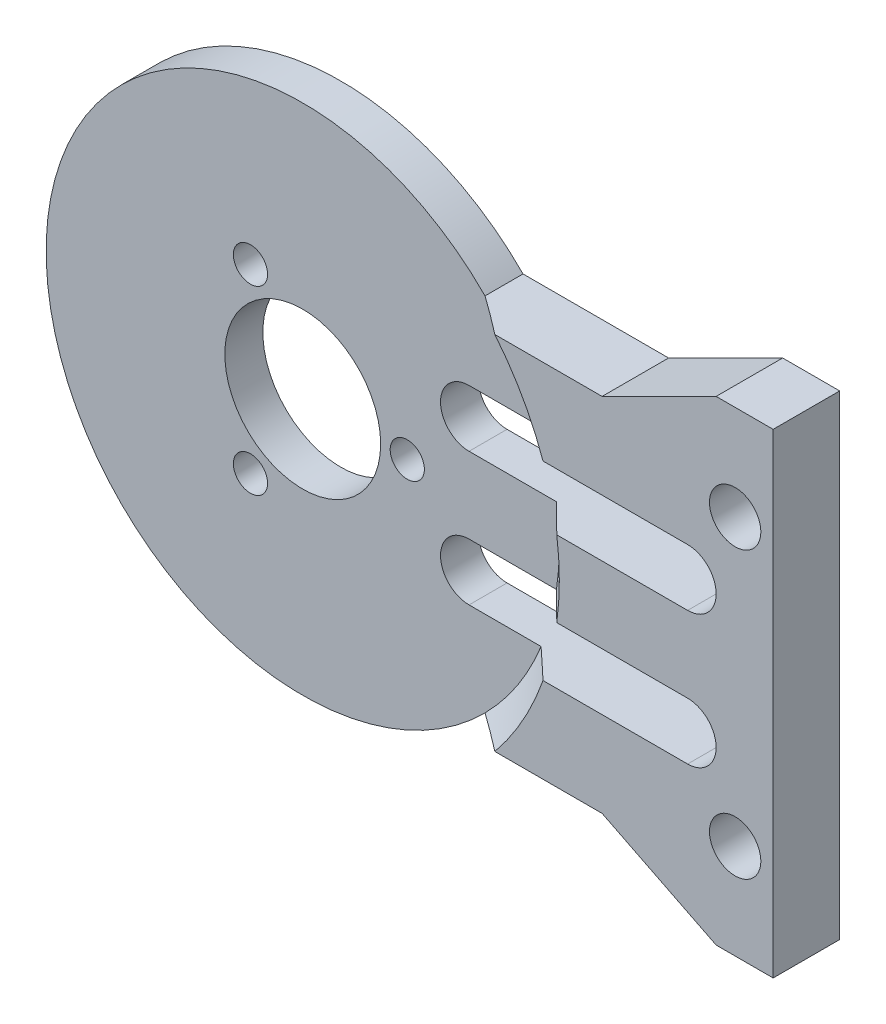
ISO-10303-21;
HEADER;
FILE_DESCRIPTION(('STEP AP214'),'2;1');
FILE_NAME('part.step','',(''),(''),'','','');
FILE_SCHEMA(('AUTOMOTIVE_DESIGN { 1 0 10303 214 1 1 1 1 }'));
ENDSEC;
DATA;
#1=APPLICATION_CONTEXT('core data for automotive mechanical design processes');
#2=APPLICATION_PROTOCOL_DEFINITION('international standard','automotive_design',2000,#1);
#3=PRODUCT_CONTEXT('',#1,'mechanical');
#4=PRODUCT('Part','Part','',(#3));
#5=PRODUCT_RELATED_PRODUCT_CATEGORY('part','',(#4));
#6=PRODUCT_DEFINITION_FORMATION('','',#4);
#7=PRODUCT_DEFINITION_CONTEXT('part definition',#1,'design');
#8=PRODUCT_DEFINITION('design','',#6,#7);
#9=PRODUCT_DEFINITION_SHAPE('','',#8);
#10=(LENGTH_UNIT() NAMED_UNIT(*) SI_UNIT(.MILLI.,.METRE.));
#11=(NAMED_UNIT(*) PLANE_ANGLE_UNIT() SI_UNIT($,.RADIAN.));
#12=(NAMED_UNIT(*) SI_UNIT($,.STERADIAN.) SOLID_ANGLE_UNIT());
#13=UNCERTAINTY_MEASURE_WITH_UNIT(LENGTH_MEASURE(1.E-05),#10,'distance_accuracy_value','');
#14=(GEOMETRIC_REPRESENTATION_CONTEXT(3) GLOBAL_UNCERTAINTY_ASSIGNED_CONTEXT((#13)) GLOBAL_UNIT_ASSIGNED_CONTEXT((#10,
#11,#12)) REPRESENTATION_CONTEXT('',''));
#15=CARTESIAN_POINT('',(0.,0.,0.));
#16=DIRECTION('',(0.,0.,1.));
#17=DIRECTION('',(1.,0.,0.));
#18=AXIS2_PLACEMENT_3D('',#15,#16,#17);
#19=CARTESIAN_POINT('',(0.,0.,3.50000000000002));
#20=DIRECTION('',(0.,0.,1.));
#21=DIRECTION('',(0.,-1.,0.));
#22=AXIS2_PLACEMENT_3D('',#19,#20,#21);
#23=CONICAL_SURFACE('',#22,15.,0.785398163397448);
#24=CARTESIAN_POINT('',(0.,0.,3.50000000000002));
#25=DIRECTION('',(0.,0.,1.));
#26=DIRECTION('',(0.,-1.,0.));
#27=AXIS2_PLACEMENT_3D('',#24,#25,#26);
#28=CIRCLE('',#27,15.);
#29=CARTESIAN_POINT('',(14.142135623731,-5.,3.50000000000003));
#30=VERTEX_POINT('',#29);
#31=CARTESIAN_POINT('',(11.6081867662439,-9.5,3.50000000000001));
#32=VERTEX_POINT('',#31);
#33=EDGE_CURVE('E139',#30,#32,#28,.F.);
#34=ORIENTED_EDGE('',*,*,#33,.F.);
#35=CARTESIAN_POINT('',(12.5399362039845,-5.,2.00000000000002));
#36=CARTESIAN_POINT('',(12.6739419625664,-5.,2.12447668089387));
#37=CARTESIAN_POINT('',(12.8078120502152,-5.,2.24909931975893));
#38=CARTESIAN_POINT('',(13.0753009891734,-5.,2.49861302935809));
#39=CARTESIAN_POINT('',(13.2089198413421,-5.,2.62350409917075));
#40=CARTESIAN_POINT('',(13.4759272658063,-5.,2.87353197709315));
#41=CARTESIAN_POINT('',(13.6093158382177,-5.,2.99866878507895));
#42=CARTESIAN_POINT('',(13.8758806951531,-5.,3.24916922865584));
#43=CARTESIAN_POINT('',(14.0090569789481,-5.,3.3745328650226));
#44=CARTESIAN_POINT('',(14.142135623731,-5.,3.50000000000003));
#45=B_SPLINE_CURVE_WITH_KNOTS('',3,(#35,#36,#37,#38,#39,#40,#41,#42,#43,#44),.UNSPECIFIED.,.F.,
.F.,(4,2,2,2,4),(0.,0.548696328755875,1.09739077699587,1.64608494855603,2.19478100003117),.UNSPECIFIED.);
#46=CARTESIAN_POINT('',(12.5399362039845,-5.,2.));
#47=VERTEX_POINT('',#46);
#48=EDGE_CURVE('E295',#47,#30,#45,.T.);
#49=ORIENTED_EDGE('',*,*,#48,.F.);
#50=CARTESIAN_POINT('',(0.,0.,2.));
#51=DIRECTION('',(0.,0.,1.));
#52=DIRECTION('',(0.,-1.,0.));
#53=AXIS2_PLACEMENT_3D('',#50,#51,#52);
#54=CIRCLE('',#53,13.5);
#55=CARTESIAN_POINT('',(9.59166304662544,-9.5,2.));
#56=VERTEX_POINT('',#55);
#57=EDGE_CURVE('E476',#56,#47,#54,.T.);
#58=ORIENTED_EDGE('',*,*,#57,.F.);
#59=CARTESIAN_POINT('',(11.6081867662439,-9.5,3.5));
#60=CARTESIAN_POINT('',(11.4425349588355,-9.5,3.37181039171212));
#61=CARTESIAN_POINT('',(11.2763537392727,-9.5,3.24430205398962));
#62=CARTESIAN_POINT('',(10.9428462642512,-9.5,2.9908283329708));
#63=CARTESIAN_POINT('',(10.7755201292658,-9.5,2.86486279111046));
#64=CARTESIAN_POINT('',(10.4395995981307,-9.5,2.6146264080941));
#65=CARTESIAN_POINT('',(10.2710051815198,-9.5,2.49035559437036));
#66=CARTESIAN_POINT('',(9.9324127559008,-9.5,2.24370462569485));
#67=CARTESIAN_POINT('',(9.76241460313073,-9.5,2.12132466817207));
#68=CARTESIAN_POINT('',(9.59166304662544,-9.5,2.));
#69=B_SPLINE_CURVE_WITH_KNOTS('',3,(#59,#60,#61,#62,#63,#64,#65,#66,#67,#68),.UNSPECIFIED.,.F.,
.F.,(4,2,2,2,4),(0.,0.628377900400823,1.25669066667378,1.88501359129552,2.51340168327007),.UNSPECIFIED.);
#70=EDGE_CURVE('E333',#32,#56,#69,.T.);
#71=ORIENTED_EDGE('',*,*,#70,.F.);
#72=EDGE_LOOP('',(#34,#49,#58,#71));
#73=FACE_BOUND('',#72,.T.);
#74=ADVANCED_FACE('F17',(#73),#23,.F.);
#75=CARTESIAN_POINT('',(0.,0.,3.5));
#76=DIRECTION('',(0.,0.,1.));
#77=DIRECTION('',(1.,0.,0.));
#78=AXIS2_PLACEMENT_3D('',#75,#76,#77);
#79=CONICAL_SURFACE('',#78,15.,0.785398163397448);
#80=CARTESIAN_POINT('',(0.,0.,2.00000000000001));
#81=DIRECTION('',(0.,0.,1.));
#82=DIRECTION('',(1.,0.,0.));
#83=AXIS2_PLACEMENT_3D('',#80,#81,#82);
#84=CIRCLE('',#83,13.5);
#85=CARTESIAN_POINT('',(13.3510299228187,-2.,2.00000000000001));
#86=VERTEX_POINT('',#85);
#87=CARTESIAN_POINT('',(13.3510299228187,2.,2.));
#88=VERTEX_POINT('',#87);
#89=EDGE_CURVE('E473',#86,#88,#84,.T.);
#90=ORIENTED_EDGE('',*,*,#89,.F.);
#91=CARTESIAN_POINT('',(14.8660687473185,-2.,3.5));
#92=CARTESIAN_POINT('',(14.6136948517418,-2.,3.24986609751232));
#93=CARTESIAN_POINT('',(14.3612546690459,-2.,2.99979914673077));
#94=CARTESIAN_POINT('',(13.856241727547,-2.,2.49979914672979));
#95=CARTESIAN_POINT('',(13.6036689687429,-2.,2.24986609751134));
#96=CARTESIAN_POINT('',(13.3510299228187,-2.,2.));
#97=B_SPLINE_CURVE_WITH_KNOTS('',3,(#91,#92,#93,#94,#95,#96),.UNSPECIFIED.,.F.,.F.,(4,2,4),(0.,
1.06599049311637,2.13198099412171),.UNSPECIFIED.);
#98=CARTESIAN_POINT('',(14.8660687473185,-2.,3.5));
#99=VERTEX_POINT('',#98);
#100=EDGE_CURVE('E134',#99,#86,#97,.T.);
#101=ORIENTED_EDGE('',*,*,#100,.F.);
#102=CARTESIAN_POINT('',(0.,0.,3.5));
#103=DIRECTION('',(0.,0.,1.));
#104=DIRECTION('',(1.,0.,0.));
#105=AXIS2_PLACEMENT_3D('',#102,#103,#104);
#106=CIRCLE('',#105,15.);
#107=CARTESIAN_POINT('',(14.8660687473185,2.,3.5));
#108=VERTEX_POINT('',#107);
#109=EDGE_CURVE('E21',#108,#99,#106,.F.);
#110=ORIENTED_EDGE('',*,*,#109,.F.);
#111=CARTESIAN_POINT('',(14.8660687473185,2.,3.5));
#112=CARTESIAN_POINT('',(14.6136948517418,2.,3.24986609751232));
#113=CARTESIAN_POINT('',(14.3612546690459,2.,2.99979914673077));
#114=CARTESIAN_POINT('',(13.856241727547,2.,2.49979914672979));
#115=CARTESIAN_POINT('',(13.6036689687429,2.,2.24986609751134));
#116=CARTESIAN_POINT('',(13.3510299228187,2.,2.00000000000001));
#117=B_SPLINE_CURVE_WITH_KNOTS('',3,(#111,#112,#113,#114,#115,#116),.UNSPECIFIED.,.F.,.F.,(4,2,
4),(0.,1.06599049311637,2.13198099412171),.UNSPECIFIED.);
#118=EDGE_CURVE('E133',#108,#88,#117,.T.);
#119=ORIENTED_EDGE('',*,*,#118,.T.);
#120=EDGE_LOOP('',(#90,#101,#110,#119));
#121=FACE_BOUND('',#120,.T.);
#122=ADVANCED_FACE('F132',(#121),#79,.F.);
#123=CARTESIAN_POINT('',(6.375,0.,3.5));
#124=DIRECTION('',(0.,0.,1.));
#125=DIRECTION('',(1.,0.,0.));
#126=AXIS2_PLACEMENT_3D('',#123,#124,#125);
#127=PLANE('',#126);
#128=CARTESIAN_POINT('',(24.25,7.5,3.5));
#129=DIRECTION('',(0.,0.,-1.));
#130=DIRECTION('',(-1.,0.,0.));
#131=AXIS2_PLACEMENT_3D('',#128,#129,#130);
#132=CIRCLE('',#131,1.35);
#133=CARTESIAN_POINT('',(22.9,7.5,3.5));
#134=VERTEX_POINT('',#133);
#135=EDGE_CURVE('E313',#134,#134,#132,.T.);
#136=ORIENTED_EDGE('',*,*,#135,.T.);
#137=EDGE_LOOP('',(#136));
#138=FACE_BOUND('',#137,.T.);
#139=CARTESIAN_POINT('',(24.25,-7.5,3.5));
#140=DIRECTION('',(0.,0.,-1.));
#141=DIRECTION('',(-1.,0.,0.));
#142=AXIS2_PLACEMENT_3D('',#139,#140,#141);
#143=CIRCLE('',#142,1.35);
#144=CARTESIAN_POINT('',(22.9,-7.5,3.5));
#145=VERTEX_POINT('',#144);
#146=EDGE_CURVE('E316',#145,#145,#143,.T.);
#147=ORIENTED_EDGE('',*,*,#146,.T.);
#148=EDGE_LOOP('',(#147));
#149=FACE_BOUND('',#148,.T.);
#150=DIRECTION('',(-0.894427190999916,-0.447213595499958,0.));
#151=VECTOR('',#150,1.);
#152=CARTESIAN_POINT('',(23.25,12.5,3.5));
#153=LINE('',#152,#151);
#154=CARTESIAN_POINT('',(17.25,9.5,3.5));
#155=VERTEX_POINT('',#154);
#156=CARTESIAN_POINT('',(23.25,12.5,3.5));
#157=VERTEX_POINT('',#156);
#158=EDGE_CURVE('E166',#155,#157,#153,.F.);
#159=ORIENTED_EDGE('',*,*,#158,.F.);
#160=DIRECTION('',(1.,0.,0.));
#161=VECTOR('',#160,1.);
#162=CARTESIAN_POINT('',(17.25,9.5,3.5));
#163=LINE('',#162,#161);
#164=CARTESIAN_POINT('',(11.6081867662439,9.5,3.5));
#165=VERTEX_POINT('',#164);
#166=EDGE_CURVE('E332',#165,#155,#163,.T.);
#167=ORIENTED_EDGE('',*,*,#166,.F.);
#168=CARTESIAN_POINT('',(0.,0.,3.5));
#169=DIRECTION('',(0.,0.,1.));
#170=DIRECTION('',(1.,0.,0.));
#171=AXIS2_PLACEMENT_3D('',#168,#169,#170);
#172=CIRCLE('',#171,15.);
#173=CARTESIAN_POINT('',(14.142135623731,5.,3.5));
#174=VERTEX_POINT('',#173);
#175=EDGE_CURVE('E483',#165,#174,#172,.F.);
#176=ORIENTED_EDGE('',*,*,#175,.T.);
#177=DIRECTION('',(1.,0.,0.));
#178=VECTOR('',#177,1.);
#179=CARTESIAN_POINT('',(8.75,5.,3.5));
#180=LINE('',#179,#178);
#181=CARTESIAN_POINT('',(21.75,5.,3.5));
#182=VERTEX_POINT('',#181);
#183=EDGE_CURVE('E500',#174,#182,#180,.T.);
#184=ORIENTED_EDGE('',*,*,#183,.T.);
#185=CARTESIAN_POINT('',(21.75,3.5,3.5));
#186=DIRECTION('',(0.,0.,-1.));
#187=DIRECTION('',(-1.,0.,0.));
#188=AXIS2_PLACEMENT_3D('',#185,#186,#187);
#189=CIRCLE('',#188,1.5);
#190=CARTESIAN_POINT('',(21.75,2.,3.5));
#191=VERTEX_POINT('',#190);
#192=EDGE_CURVE('E153',#182,#191,#189,.T.);
#193=ORIENTED_EDGE('',*,*,#192,.T.);
#194=DIRECTION('',(1.,0.,0.));
#195=VECTOR('',#194,1.);
#196=CARTESIAN_POINT('',(21.75,2.,3.5));
#197=LINE('',#196,#195);
#198=EDGE_CURVE('E144',#191,#108,#197,.F.);
#199=ORIENTED_EDGE('',*,*,#198,.T.);
#200=ORIENTED_EDGE('',*,*,#109,.T.);
#201=DIRECTION('',(1.,0.,0.));
#202=VECTOR('',#201,1.);
#203=CARTESIAN_POINT('',(21.75,-2.,3.5));
#204=LINE('',#203,#202);
#205=CARTESIAN_POINT('',(21.75,-2.,3.5));
#206=VERTEX_POINT('',#205);
#207=EDGE_CURVE('E160',#206,#99,#204,.F.);
#208=ORIENTED_EDGE('',*,*,#207,.F.);
#209=CARTESIAN_POINT('',(21.75,-3.5,3.5));
#210=DIRECTION('',(0.,0.,1.));
#211=DIRECTION('',(1.,0.,0.));
#212=AXIS2_PLACEMENT_3D('',#209,#210,#211);
#213=CIRCLE('',#212,1.5);
#214=CARTESIAN_POINT('',(21.75,-5.,3.5));
#215=VERTEX_POINT('',#214);
#216=EDGE_CURVE('E301',#206,#215,#213,.F.);
#217=ORIENTED_EDGE('',*,*,#216,.T.);
#218=DIRECTION('',(1.,0.,0.));
#219=VECTOR('',#218,1.);
#220=CARTESIAN_POINT('',(8.75,-5.,3.5));
#221=LINE('',#220,#219);
#222=EDGE_CURVE('E300',#30,#215,#221,.T.);
#223=ORIENTED_EDGE('',*,*,#222,.F.);
#224=ORIENTED_EDGE('',*,*,#33,.T.);
#225=DIRECTION('',(1.,0.,0.));
#226=VECTOR('',#225,1.);
#227=CARTESIAN_POINT('',(9.59166304662544,-9.5,3.5));
#228=LINE('',#227,#226);
#229=CARTESIAN_POINT('',(17.25,-9.5,3.5));
#230=VERTEX_POINT('',#229);
#231=EDGE_CURVE('E194',#230,#32,#228,.F.);
#232=ORIENTED_EDGE('',*,*,#231,.F.);
#233=DIRECTION('',(0.894427190999916,-0.447213595499958,0.));
#234=VECTOR('',#233,1.);
#235=CARTESIAN_POINT('',(17.25,-9.5,3.5));
#236=LINE('',#235,#234);
#237=CARTESIAN_POINT('',(23.25,-12.5,3.5));
#238=VERTEX_POINT('',#237);
#239=EDGE_CURVE('E191',#238,#230,#236,.F.);
#240=ORIENTED_EDGE('',*,*,#239,.F.);
#241=DIRECTION('',(1.,0.,0.));
#242=VECTOR('',#241,1.);
#243=CARTESIAN_POINT('',(23.25,-12.5,3.5));
#244=LINE('',#243,#242);
#245=CARTESIAN_POINT('',(26.25,-12.5,3.5));
#246=VERTEX_POINT('',#245);
#247=EDGE_CURVE('E185',#246,#238,#244,.F.);
#248=ORIENTED_EDGE('',*,*,#247,.F.);
#249=DIRECTION('',(0.,1.,0.));
#250=VECTOR('',#249,1.);
#251=CARTESIAN_POINT('',(26.25,-12.5,3.5));
#252=LINE('',#251,#250);
#253=CARTESIAN_POINT('',(26.25,12.5,3.5));
#254=VERTEX_POINT('',#253);
#255=EDGE_CURVE('E179',#254,#246,#252,.F.);
#256=ORIENTED_EDGE('',*,*,#255,.F.);
#257=DIRECTION('',(-1.,0.,0.));
#258=VECTOR('',#257,1.);
#259=CARTESIAN_POINT('',(26.25,12.5,3.5));
#260=LINE('',#259,#258);
#261=EDGE_CURVE('E173',#157,#254,#260,.F.);
#262=ORIENTED_EDGE('',*,*,#261,.F.);
#263=EDGE_LOOP('',(#159,#167,#176,#184,#193,#199,#200,#208,#217,#223,#224,#232,#240,#248,#256,#262));
#264=FACE_BOUND('',#263,.T.);
#265=ADVANCED_FACE('F151',(#138,#149,#264),#127,.T.);
#266=CARTESIAN_POINT('',(0.,0.,3.50000000000002));
#267=DIRECTION('',(0.,0.,1.));
#268=DIRECTION('',(1.,0.,0.));
#269=AXIS2_PLACEMENT_3D('',#266,#267,#268);
#270=CONICAL_SURFACE('',#269,15.,0.785398163397448);
#271=ORIENTED_EDGE('',*,*,#175,.F.);
#272=CARTESIAN_POINT('',(9.59166304662544,9.5,2.));
#273=CARTESIAN_POINT('',(9.76241460313074,9.5,2.12132466817208));
#274=CARTESIAN_POINT('',(9.9324127559008,9.5,2.24370462569485));
#275=CARTESIAN_POINT('',(10.2710051815198,9.5,2.49035559437036));
#276=CARTESIAN_POINT('',(10.4395995981307,9.5,2.61462640809411));
#277=CARTESIAN_POINT('',(10.7755201292658,9.5,2.86486279111046));
#278=CARTESIAN_POINT('',(10.9428462642512,9.5,2.9908283329708));
#279=CARTESIAN_POINT('',(11.2763537392727,9.5,3.24430205398961));
#280=CARTESIAN_POINT('',(11.4425349588355,9.5,3.37181039171211));
#281=CARTESIAN_POINT('',(11.6081867662439,9.5,3.5));
#282=B_SPLINE_CURVE_WITH_KNOTS('',3,(#272,#273,#274,#275,#276,#277,#278,#279,#280,#281),
.UNSPECIFIED.,.F.,.F.,(4,2,2,2,4),(0.,0.628388091974549,1.25671101659629,1.88502378286924,
2.51340168327006),.UNSPECIFIED.);
#283=CARTESIAN_POINT('',(9.59166304662545,9.5,2.00000000000001));
#284=VERTEX_POINT('',#283);
#285=EDGE_CURVE('E325',#284,#165,#282,.T.);
#286=ORIENTED_EDGE('',*,*,#285,.F.);
#287=CARTESIAN_POINT('',(0.,0.,2.00000000000002));
#288=DIRECTION('',(0.,0.,1.));
#289=DIRECTION('',(1.,0.,0.));
#290=AXIS2_PLACEMENT_3D('',#287,#288,#289);
#291=CIRCLE('',#290,13.5);
#292=CARTESIAN_POINT('',(12.5399362039845,5.,2.00000000000002));
#293=VERTEX_POINT('',#292);
#294=EDGE_CURVE('E479',#293,#284,#291,.T.);
#295=ORIENTED_EDGE('',*,*,#294,.F.);
#296=CARTESIAN_POINT('',(12.5399362039845,5.,2.00000000000002));
#297=CARTESIAN_POINT('',(12.6739419625664,5.,2.12447668089387));
#298=CARTESIAN_POINT('',(12.8078120502152,5.,2.24909931975893));
#299=CARTESIAN_POINT('',(13.0753009891734,5.,2.49861302935809));
#300=CARTESIAN_POINT('',(13.2089198413421,5.,2.62350409917075));
#301=CARTESIAN_POINT('',(13.4759272658063,5.,2.87353197709315));
#302=CARTESIAN_POINT('',(13.6093158382177,5.,2.99866878507895));
#303=CARTESIAN_POINT('',(13.8758806951531,5.,3.24916922865583));
#304=CARTESIAN_POINT('',(14.0090569789481,5.,3.3745328650226));
#305=CARTESIAN_POINT('',(14.142135623731,5.,3.50000000000002));
#306=B_SPLINE_CURVE_WITH_KNOTS('',3,(#296,#297,#298,#299,#300,#301,#302,#303,#304,#305),
.UNSPECIFIED.,.F.,.F.,(4,2,2,2,4),(0.,0.54869632875587,1.09739077699586,1.64608494855602,
2.19478100003116),.UNSPECIFIED.);
#307=EDGE_CURVE('E235',#293,#174,#306,.T.);
#308=ORIENTED_EDGE('',*,*,#307,.T.);
#309=EDGE_LOOP('',(#271,#286,#295,#308));
#310=FACE_BOUND('',#309,.T.);
#311=ADVANCED_FACE('F245',(#310),#270,.F.);
#312=CARTESIAN_POINT('',(0.,0.,2.));
#313=DIRECTION('',(0.,0.,1.));
#314=DIRECTION('',(1.,0.,0.));
#315=AXIS2_PLACEMENT_3D('',#312,#313,#314);
#316=PLANE('',#315);
#317=CARTESIAN_POINT('',(0.,0.,2.));
#318=DIRECTION('',(0.,0.,1.));
#319=DIRECTION('',(1.,0.,0.));
#320=AXIS2_PLACEMENT_3D('',#317,#318,#319);
#321=CIRCLE('',#320,4.1);
#322=CARTESIAN_POINT('',(4.1,0.,2.));
#323=VERTEX_POINT('',#322);
#324=EDGE_CURVE('E231',#323,#323,#321,.F.);
#325=ORIENTED_EDGE('',*,*,#324,.T.);
#326=EDGE_LOOP('',(#325));
#327=FACE_BOUND('',#326,.T.);
#328=CARTESIAN_POINT('',(-2.75,4.76313972081441,2.));
#329=DIRECTION('',(0.,0.,-1.));
#330=DIRECTION('',(-1.,0.,0.));
#331=AXIS2_PLACEMENT_3D('',#328,#329,#330);
#332=CIRCLE('',#331,0.9);
#333=CARTESIAN_POINT('',(-3.65,4.76313972081441,2.));
#334=VERTEX_POINT('',#333);
#335=EDGE_CURVE('E304',#334,#334,#332,.T.);
#336=ORIENTED_EDGE('',*,*,#335,.T.);
#337=EDGE_LOOP('',(#336));
#338=FACE_BOUND('',#337,.T.);
#339=CARTESIAN_POINT('',(-2.75,-4.76313972081441,2.));
#340=DIRECTION('',(0.,0.,-1.));
#341=DIRECTION('',(-1.,0.,0.));
#342=AXIS2_PLACEMENT_3D('',#339,#340,#341);
#343=CIRCLE('',#342,0.9);
#344=CARTESIAN_POINT('',(-3.65,-4.76313972081441,2.));
#345=VERTEX_POINT('',#344);
#346=EDGE_CURVE('E307',#345,#345,#343,.T.);
#347=ORIENTED_EDGE('',*,*,#346,.T.);
#348=EDGE_LOOP('',(#347));
#349=FACE_BOUND('',#348,.T.);
#350=CARTESIAN_POINT('',(5.5,0.,2.));
#351=DIRECTION('',(0.,0.,-1.));
#352=DIRECTION('',(-1.,0.,0.));
#353=AXIS2_PLACEMENT_3D('',#350,#351,#352);
#354=CIRCLE('',#353,0.9);
#355=CARTESIAN_POINT('',(4.6,0.,2.));
#356=VERTEX_POINT('',#355);
#357=EDGE_CURVE('E310',#356,#356,#354,.T.);
#358=ORIENTED_EDGE('',*,*,#357,.T.);
#359=EDGE_LOOP('',(#358));
#360=FACE_BOUND('',#359,.T.);
#361=DIRECTION('',(1.,0.,0.));
#362=VECTOR('',#361,1.);
#363=CARTESIAN_POINT('',(21.75,-2.,2.));
#364=LINE('',#363,#362);
#365=CARTESIAN_POINT('',(8.75,-2.,2.));
#366=VERTEX_POINT('',#365);
#367=EDGE_CURVE('E163',#86,#366,#364,.F.);
#368=ORIENTED_EDGE('',*,*,#367,.F.);
#369=ORIENTED_EDGE('',*,*,#89,.T.);
#370=DIRECTION('',(1.,0.,0.));
#371=VECTOR('',#370,1.);
#372=CARTESIAN_POINT('',(21.75,2.,2.));
#373=LINE('',#372,#371);
#374=CARTESIAN_POINT('',(8.75,2.,2.));
#375=VERTEX_POINT('',#374);
#376=EDGE_CURVE('E147',#88,#375,#373,.F.);
#377=ORIENTED_EDGE('',*,*,#376,.T.);
#378=CARTESIAN_POINT('',(8.75,3.5,2.));
#379=DIRECTION('',(0.,0.,-1.));
#380=DIRECTION('',(-1.,0.,0.));
#381=AXIS2_PLACEMENT_3D('',#378,#379,#380);
#382=CIRCLE('',#381,1.5);
#383=CARTESIAN_POINT('',(8.75,5.,2.));
#384=VERTEX_POINT('',#383);
#385=EDGE_CURVE('E244',#375,#384,#382,.T.);
#386=ORIENTED_EDGE('',*,*,#385,.T.);
#387=DIRECTION('',(1.,0.,0.));
#388=VECTOR('',#387,1.);
#389=CARTESIAN_POINT('',(8.75,5.,2.));
#390=LINE('',#389,#388);
#391=EDGE_CURVE('E243',#384,#293,#390,.T.);
#392=ORIENTED_EDGE('',*,*,#391,.T.);
#393=ORIENTED_EDGE('',*,*,#294,.T.);
#394=CARTESIAN_POINT('',(0.,0.,2.));
#395=DIRECTION('',(0.,0.,1.));
#396=DIRECTION('',(1.,0.,0.));
#397=AXIS2_PLACEMENT_3D('',#394,#395,#396);
#398=CIRCLE('',#397,13.5);
#399=EDGE_CURVE('E320',#56,#284,#398,.F.);
#400=ORIENTED_EDGE('',*,*,#399,.F.);
#401=ORIENTED_EDGE('',*,*,#57,.T.);
#402=DIRECTION('',(1.,0.,0.));
#403=VECTOR('',#402,1.);
#404=CARTESIAN_POINT('',(8.75,-5.,2.));
#405=LINE('',#404,#403);
#406=CARTESIAN_POINT('',(8.75,-5.,2.));
#407=VERTEX_POINT('',#406);
#408=EDGE_CURVE('E513',#407,#47,#405,.T.);
#409=ORIENTED_EDGE('',*,*,#408,.F.);
#410=CARTESIAN_POINT('',(8.75,-3.5,2.));
#411=DIRECTION('',(0.,0.,1.));
#412=DIRECTION('',(1.,0.,0.));
#413=AXIS2_PLACEMENT_3D('',#410,#411,#412);
#414=CIRCLE('',#413,1.5);
#415=EDGE_CURVE('E277',#407,#366,#414,.F.);
#416=ORIENTED_EDGE('',*,*,#415,.T.);
#417=EDGE_LOOP('',(#368,#369,#377,#386,#392,#393,#400,#401,#409,#416));
#418=FACE_BOUND('',#417,.T.);
#419=ADVANCED_FACE('F369',(#327,#338,#349,#360,#418),#316,.T.);
#420=CARTESIAN_POINT('',(9.59166304662544,-9.5,0.));
#421=DIRECTION('',(0.,-1.,0.));
#422=DIRECTION('',(1.,0.,0.));
#423=AXIS2_PLACEMENT_3D('',#420,#421,#422);
#424=PLANE('',#423);
#425=DIRECTION('',(0.,0.,1.));
#426=VECTOR('',#425,1.);
#427=CARTESIAN_POINT('',(17.25,-9.5,0.));
#428=LINE('',#427,#426);
#429=CARTESIAN_POINT('',(17.25,-9.5,0.));
#430=VERTEX_POINT('',#429);
#431=EDGE_CURVE('E188',#230,#430,#428,.F.);
#432=ORIENTED_EDGE('',*,*,#431,.F.);
#433=ORIENTED_EDGE('',*,*,#231,.T.);
#434=ORIENTED_EDGE('',*,*,#70,.T.);
#435=DIRECTION('',(0.,0.,1.));
#436=VECTOR('',#435,1.);
#437=CARTESIAN_POINT('',(9.59166304662543,-9.50000000000001,0.));
#438=LINE('',#437,#436);
#439=CARTESIAN_POINT('',(9.59166304662544,-9.5,0.));
#440=VERTEX_POINT('',#439);
#441=EDGE_CURVE('E319',#440,#56,#438,.T.);
#442=ORIENTED_EDGE('',*,*,#441,.F.);
#443=DIRECTION('',(1.,0.,0.));
#444=VECTOR('',#443,1.);
#445=CARTESIAN_POINT('',(6.375,-9.5,0.));
#446=LINE('',#445,#444);
#447=EDGE_CURVE('E234',#440,#430,#446,.T.);
#448=ORIENTED_EDGE('',*,*,#447,.T.);
#449=EDGE_LOOP('',(#432,#433,#434,#442,#448));
#450=FACE_BOUND('',#449,.T.);
#451=ADVANCED_FACE('F365',(#450),#424,.T.);
#452=CARTESIAN_POINT('',(17.25,-9.5,0.));
#453=DIRECTION('',(-0.447213595499958,-0.894427190999916,0.));
#454=DIRECTION('',(0.894427190999916,-0.447213595499958,0.));
#455=AXIS2_PLACEMENT_3D('',#452,#453,#454);
#456=PLANE('',#455);
#457=ORIENTED_EDGE('',*,*,#239,.T.);
#458=ORIENTED_EDGE('',*,*,#431,.T.);
#459=DIRECTION('',(0.894427190999916,-0.447213595499958,0.));
#460=VECTOR('',#459,1.);
#461=CARTESIAN_POINT('',(17.25,-9.5,0.));
#462=LINE('',#461,#460);
#463=CARTESIAN_POINT('',(23.25,-12.5,0.));
#464=VERTEX_POINT('',#463);
#465=EDGE_CURVE('E453',#430,#464,#462,.T.);
#466=ORIENTED_EDGE('',*,*,#465,.T.);
#467=DIRECTION('',(0.,0.,1.));
#468=VECTOR('',#467,1.);
#469=CARTESIAN_POINT('',(23.25,-12.5,0.));
#470=LINE('',#469,#468);
#471=EDGE_CURVE('E182',#238,#464,#470,.F.);
#472=ORIENTED_EDGE('',*,*,#471,.F.);
#473=EDGE_LOOP('',(#457,#458,#466,#472));
#474=FACE_BOUND('',#473,.T.);
#475=ADVANCED_FACE('F362',(#474),#456,.T.);
#476=CARTESIAN_POINT('',(23.25,-12.5,0.));
#477=DIRECTION('',(0.,-1.,0.));
#478=DIRECTION('',(1.,0.,0.));
#479=AXIS2_PLACEMENT_3D('',#476,#477,#478);
#480=PLANE('',#479);
#481=ORIENTED_EDGE('',*,*,#247,.T.);
#482=ORIENTED_EDGE('',*,*,#471,.T.);
#483=DIRECTION('',(1.,0.,0.));
#484=VECTOR('',#483,1.);
#485=CARTESIAN_POINT('',(6.375,-12.5,0.));
#486=LINE('',#485,#484);
#487=CARTESIAN_POINT('',(26.25,-12.5,0.));
#488=VERTEX_POINT('',#487);
#489=EDGE_CURVE('E444',#464,#488,#486,.T.);
#490=ORIENTED_EDGE('',*,*,#489,.T.);
#491=DIRECTION('',(0.,0.,-1.));
#492=VECTOR('',#491,1.);
#493=CARTESIAN_POINT('',(26.25,-12.5,0.));
#494=LINE('',#493,#492);
#495=EDGE_CURVE('E176',#246,#488,#494,.T.);
#496=ORIENTED_EDGE('',*,*,#495,.F.);
#497=EDGE_LOOP('',(#481,#482,#490,#496));
#498=FACE_BOUND('',#497,.T.);
#499=ADVANCED_FACE('F358',(#498),#480,.T.);
#500=CARTESIAN_POINT('',(26.25,-12.5,0.));
#501=DIRECTION('',(1.,0.,0.));
#502=DIRECTION('',(0.,0.,-1.));
#503=AXIS2_PLACEMENT_3D('',#500,#501,#502);
#504=PLANE('',#503);
#505=ORIENTED_EDGE('',*,*,#255,.T.);
#506=ORIENTED_EDGE('',*,*,#495,.T.);
#507=DIRECTION('',(0.,1.,0.));
#508=VECTOR('',#507,1.);
#509=CARTESIAN_POINT('',(26.25,0.,0.));
#510=LINE('',#509,#508);
#511=CARTESIAN_POINT('',(26.25,12.5,0.));
#512=VERTEX_POINT('',#511);
#513=EDGE_CURVE('E425',#488,#512,#510,.T.);
#514=ORIENTED_EDGE('',*,*,#513,.T.);
#515=DIRECTION('',(0.,0.,1.));
#516=VECTOR('',#515,1.);
#517=CARTESIAN_POINT('',(26.25,12.5,0.));
#518=LINE('',#517,#516);
#519=EDGE_CURVE('E170',#254,#512,#518,.F.);
#520=ORIENTED_EDGE('',*,*,#519,.F.);
#521=EDGE_LOOP('',(#505,#506,#514,#520));
#522=FACE_BOUND('',#521,.T.);
#523=ADVANCED_FACE('F354',(#522),#504,.T.);
#524=CARTESIAN_POINT('',(26.25,12.5,0.));
#525=DIRECTION('',(0.,1.,0.));
#526=DIRECTION('',(-1.,0.,0.));
#527=AXIS2_PLACEMENT_3D('',#524,#525,#526);
#528=PLANE('',#527);
#529=ORIENTED_EDGE('',*,*,#261,.T.);
#530=ORIENTED_EDGE('',*,*,#519,.T.);
#531=DIRECTION('',(1.,0.,0.));
#532=VECTOR('',#531,1.);
#533=CARTESIAN_POINT('',(6.375,12.5,0.));
#534=LINE('',#533,#532);
#535=CARTESIAN_POINT('',(23.25,12.5,0.));
#536=VERTEX_POINT('',#535);
#537=EDGE_CURVE('E423',#512,#536,#534,.F.);
#538=ORIENTED_EDGE('',*,*,#537,.T.);
#539=DIRECTION('',(0.,0.,1.));
#540=VECTOR('',#539,1.);
#541=CARTESIAN_POINT('',(23.25,12.5,0.));
#542=LINE('',#541,#540);
#543=EDGE_CURVE('E169',#157,#536,#542,.F.);
#544=ORIENTED_EDGE('',*,*,#543,.F.);
#545=EDGE_LOOP('',(#529,#530,#538,#544));
#546=FACE_BOUND('',#545,.T.);
#547=ADVANCED_FACE('F350',(#546),#528,.T.);
#548=CARTESIAN_POINT('',(23.25,12.5,0.));
#549=DIRECTION('',(-0.447213595499958,0.894427190999916,0.));
#550=DIRECTION('',(-0.894427190999916,-0.447213595499958,0.));
#551=AXIS2_PLACEMENT_3D('',#548,#549,#550);
#552=PLANE('',#551);
#553=ORIENTED_EDGE('',*,*,#158,.T.);
#554=ORIENTED_EDGE('',*,*,#543,.T.);
#555=DIRECTION('',(-0.894427190999916,-0.447213595499958,0.));
#556=VECTOR('',#555,1.);
#557=CARTESIAN_POINT('',(23.25,12.5,0.));
#558=LINE('',#557,#556);
#559=CARTESIAN_POINT('',(17.25,9.5,0.));
#560=VERTEX_POINT('',#559);
#561=EDGE_CURVE('E414',#536,#560,#558,.T.);
#562=ORIENTED_EDGE('',*,*,#561,.T.);
#563=DIRECTION('',(0.,0.,1.));
#564=VECTOR('',#563,1.);
#565=CARTESIAN_POINT('',(17.25,9.5,0.));
#566=LINE('',#565,#564);
#567=EDGE_CURVE('E324',#155,#560,#566,.F.);
#568=ORIENTED_EDGE('',*,*,#567,.F.);
#569=EDGE_LOOP('',(#553,#554,#562,#568));
#570=FACE_BOUND('',#569,.T.);
#571=ADVANCED_FACE('F345',(#570),#552,.T.);
#572=CARTESIAN_POINT('',(17.25,9.5,0.));
#573=DIRECTION('',(0.,1.,0.));
#574=DIRECTION('',(0.,0.,1.));
#575=AXIS2_PLACEMENT_3D('',#572,#573,#574);
#576=PLANE('',#575);
#577=DIRECTION('',(1.,0.,0.));
#578=VECTOR('',#577,1.);
#579=CARTESIAN_POINT('',(6.375,9.5,0.));
#580=LINE('',#579,#578);
#581=CARTESIAN_POINT('',(9.59166304662544,9.5,0.));
#582=VERTEX_POINT('',#581);
#583=EDGE_CURVE('E230',#560,#582,#580,.F.);
#584=ORIENTED_EDGE('',*,*,#583,.T.);
#585=DIRECTION('',(0.,0.,1.));
#586=VECTOR('',#585,1.);
#587=CARTESIAN_POINT('',(9.59166304662544,9.5,0.));
#588=LINE('',#587,#586);
#589=EDGE_CURVE('E323',#284,#582,#588,.F.);
#590=ORIENTED_EDGE('',*,*,#589,.F.);
#591=ORIENTED_EDGE('',*,*,#285,.T.);
#592=ORIENTED_EDGE('',*,*,#166,.T.);
#593=ORIENTED_EDGE('',*,*,#567,.T.);
#594=EDGE_LOOP('',(#584,#590,#591,#592,#593));
#595=FACE_BOUND('',#594,.T.);
#596=ADVANCED_FACE('F339',(#595),#576,.T.);
#597=CARTESIAN_POINT('',(0.,0.,0.));
#598=DIRECTION('',(0.,0.,1.));
#599=DIRECTION('',(1.,0.,0.));
#600=AXIS2_PLACEMENT_3D('',#597,#598,#599);
#601=CYLINDRICAL_SURFACE('',#600,13.5);
#602=CARTESIAN_POINT('',(0.,0.,0.));
#603=DIRECTION('',(0.,0.,1.));
#604=DIRECTION('',(1.,0.,0.));
#605=AXIS2_PLACEMENT_3D('',#602,#603,#604);
#606=CIRCLE('',#605,13.5);
#607=EDGE_CURVE('E227',#582,#440,#606,.T.);
#608=ORIENTED_EDGE('',*,*,#607,.T.);
#609=ORIENTED_EDGE('',*,*,#441,.T.);
#610=ORIENTED_EDGE('',*,*,#399,.T.);
#611=ORIENTED_EDGE('',*,*,#589,.T.);
#612=EDGE_LOOP('',(#608,#609,#610,#611));
#613=FACE_BOUND('',#612,.T.);
#614=ADVANCED_FACE('F344',(#613),#601,.T.);
#615=CARTESIAN_POINT('',(24.25,-7.5,3.5));
#616=DIRECTION('',(0.,0.,-1.));
#617=DIRECTION('',(-1.,0.,0.));
#618=AXIS2_PLACEMENT_3D('',#615,#616,#617);
#619=CYLINDRICAL_SURFACE('',#618,1.35);
#620=CARTESIAN_POINT('',(24.25,-7.5,0.));
#621=DIRECTION('',(0.,0.,-1.));
#622=DIRECTION('',(-1.,0.,0.));
#623=AXIS2_PLACEMENT_3D('',#620,#621,#622);
#624=CIRCLE('',#623,1.35);
#625=CARTESIAN_POINT('',(22.9,-7.5,0.));
#626=VERTEX_POINT('',#625);
#627=EDGE_CURVE('E224',#626,#626,#624,.T.);
#628=ORIENTED_EDGE('',*,*,#627,.T.);
#629=EDGE_LOOP('',(#628));
#630=FACE_BOUND('',#629,.T.);
#631=ORIENTED_EDGE('',*,*,#146,.F.);
#632=EDGE_LOOP('',(#631));
#633=FACE_BOUND('',#632,.T.);
#634=ADVANCED_FACE('F635',(#630,#633),#619,.F.);
#635=CARTESIAN_POINT('',(24.25,7.5,3.5));
#636=DIRECTION('',(0.,0.,-1.));
#637=DIRECTION('',(-1.,0.,0.));
#638=AXIS2_PLACEMENT_3D('',#635,#636,#637);
#639=CYLINDRICAL_SURFACE('',#638,1.35);
#640=CARTESIAN_POINT('',(24.25,7.5,0.));
#641=DIRECTION('',(0.,0.,-1.));
#642=DIRECTION('',(-1.,0.,0.));
#643=AXIS2_PLACEMENT_3D('',#640,#641,#642);
#644=CIRCLE('',#643,1.35);
#645=CARTESIAN_POINT('',(22.9,7.5,0.));
#646=VERTEX_POINT('',#645);
#647=EDGE_CURVE('E221',#646,#646,#644,.T.);
#648=ORIENTED_EDGE('',*,*,#647,.T.);
#649=EDGE_LOOP('',(#648));
#650=FACE_BOUND('',#649,.T.);
#651=ORIENTED_EDGE('',*,*,#135,.F.);
#652=EDGE_LOOP('',(#651));
#653=FACE_BOUND('',#652,.T.);
#654=ADVANCED_FACE('F626',(#650,#653),#639,.F.);
#655=CARTESIAN_POINT('',(5.5,0.,2.));
#656=DIRECTION('',(0.,0.,-1.));
#657=DIRECTION('',(-1.,0.,0.));
#658=AXIS2_PLACEMENT_3D('',#655,#656,#657);
#659=CYLINDRICAL_SURFACE('',#658,0.9);
#660=CARTESIAN_POINT('',(5.5,0.,0.));
#661=DIRECTION('',(0.,0.,-1.));
#662=DIRECTION('',(-1.,0.,0.));
#663=AXIS2_PLACEMENT_3D('',#660,#661,#662);
#664=CIRCLE('',#663,0.9);
#665=CARTESIAN_POINT('',(4.6,0.,0.));
#666=VERTEX_POINT('',#665);
#667=EDGE_CURVE('E218',#666,#666,#664,.T.);
#668=ORIENTED_EDGE('',*,*,#667,.T.);
#669=EDGE_LOOP('',(#668));
#670=FACE_BOUND('',#669,.T.);
#671=ORIENTED_EDGE('',*,*,#357,.F.);
#672=EDGE_LOOP('',(#671));
#673=FACE_BOUND('',#672,.T.);
#674=ADVANCED_FACE('F617',(#670,#673),#659,.F.);
#675=CARTESIAN_POINT('',(-2.75,-4.76313972081441,2.));
#676=DIRECTION('',(0.,0.,-1.));
#677=DIRECTION('',(-1.,0.,0.));
#678=AXIS2_PLACEMENT_3D('',#675,#676,#677);
#679=CYLINDRICAL_SURFACE('',#678,0.9);
#680=CARTESIAN_POINT('',(-2.75,-4.76313972081441,0.));
#681=DIRECTION('',(0.,0.,-1.));
#682=DIRECTION('',(-1.,0.,0.));
#683=AXIS2_PLACEMENT_3D('',#680,#681,#682);
#684=CIRCLE('',#683,0.9);
#685=CARTESIAN_POINT('',(-3.65,-4.76313972081441,0.));
#686=VERTEX_POINT('',#685);
#687=EDGE_CURVE('E215',#686,#686,#684,.T.);
#688=ORIENTED_EDGE('',*,*,#687,.T.);
#689=EDGE_LOOP('',(#688));
#690=FACE_BOUND('',#689,.T.);
#691=ORIENTED_EDGE('',*,*,#346,.F.);
#692=EDGE_LOOP('',(#691));
#693=FACE_BOUND('',#692,.T.);
#694=ADVANCED_FACE('F609',(#690,#693),#679,.F.);
#695=CARTESIAN_POINT('',(-2.75,4.76313972081441,2.));
#696=DIRECTION('',(0.,0.,-1.));
#697=DIRECTION('',(-1.,0.,0.));
#698=AXIS2_PLACEMENT_3D('',#695,#696,#697);
#699=CYLINDRICAL_SURFACE('',#698,0.9);
#700=CARTESIAN_POINT('',(-2.75,4.76313972081441,0.));
#701=DIRECTION('',(0.,0.,-1.));
#702=DIRECTION('',(-1.,0.,0.));
#703=AXIS2_PLACEMENT_3D('',#700,#701,#702);
#704=CIRCLE('',#703,0.9);
#705=CARTESIAN_POINT('',(-3.65,4.76313972081441,0.));
#706=VERTEX_POINT('',#705);
#707=EDGE_CURVE('E212',#706,#706,#704,.T.);
#708=ORIENTED_EDGE('',*,*,#707,.T.);
#709=EDGE_LOOP('',(#708));
#710=FACE_BOUND('',#709,.T.);
#711=ORIENTED_EDGE('',*,*,#335,.F.);
#712=EDGE_LOOP('',(#711));
#713=FACE_BOUND('',#712,.T.);
#714=ADVANCED_FACE('F601',(#710,#713),#699,.F.);
#715=CARTESIAN_POINT('',(21.75,-3.5,3.5));
#716=DIRECTION('',(0.,0.,1.));
#717=DIRECTION('',(1.,0.,0.));
#718=AXIS2_PLACEMENT_3D('',#715,#716,#717);
#719=CYLINDRICAL_SURFACE('',#718,1.5);
#720=DIRECTION('',(0.,0.,1.));
#721=VECTOR('',#720,1.);
#722=CARTESIAN_POINT('',(21.75,-5.,3.5));
#723=LINE('',#722,#721);
#724=CARTESIAN_POINT('',(21.75,-5.,0.));
#725=VERTEX_POINT('',#724);
#726=EDGE_CURVE('E508',#215,#725,#723,.F.);
#727=ORIENTED_EDGE('',*,*,#726,.F.);
#728=ORIENTED_EDGE('',*,*,#216,.F.);
#729=DIRECTION('',(0.,0.,1.));
#730=VECTOR('',#729,1.);
#731=CARTESIAN_POINT('',(21.75,-2.,3.5));
#732=LINE('',#731,#730);
#733=CARTESIAN_POINT('',(21.75,-2.,0.));
#734=VERTEX_POINT('',#733);
#735=EDGE_CURVE('E162',#734,#206,#732,.T.);
#736=ORIENTED_EDGE('',*,*,#735,.F.);
#737=CARTESIAN_POINT('',(21.75,-3.5,0.));
#738=DIRECTION('',(0.,0.,1.));
#739=DIRECTION('',(1.,0.,0.));
#740=AXIS2_PLACEMENT_3D('',#737,#738,#739);
#741=CIRCLE('',#740,1.5);
#742=EDGE_CURVE('E209',#734,#725,#741,.F.);
#743=ORIENTED_EDGE('',*,*,#742,.T.);
#744=EDGE_LOOP('',(#727,#728,#736,#743));
#745=FACE_BOUND('',#744,.T.);
#746=ADVANCED_FACE('F292',(#745),#719,.F.);
#747=CARTESIAN_POINT('',(8.75,-5.,3.5));
#748=DIRECTION('',(0.,1.,0.));
#749=DIRECTION('',(0.,0.,1.));
#750=AXIS2_PLACEMENT_3D('',#747,#748,#749);
#751=PLANE('',#750);
#752=DIRECTION('',(0.,0.,1.));
#753=VECTOR('',#752,1.);
#754=CARTESIAN_POINT('',(8.75,-5.,3.5));
#755=LINE('',#754,#753);
#756=CARTESIAN_POINT('',(8.75,-5.,0.));
#757=VERTEX_POINT('',#756);
#758=EDGE_CURVE('E516',#757,#407,#755,.T.);
#759=ORIENTED_EDGE('',*,*,#758,.T.);
#760=ORIENTED_EDGE('',*,*,#408,.T.);
#761=ORIENTED_EDGE('',*,*,#48,.T.);
#762=ORIENTED_EDGE('',*,*,#222,.T.);
#763=ORIENTED_EDGE('',*,*,#726,.T.);
#764=DIRECTION('',(1.,0.,0.));
#765=VECTOR('',#764,1.);
#766=CARTESIAN_POINT('',(6.375,-5.,0.));
#767=LINE('',#766,#765);
#768=EDGE_CURVE('E208',#725,#757,#767,.F.);
#769=ORIENTED_EDGE('',*,*,#768,.T.);
#770=EDGE_LOOP('',(#759,#760,#761,#762,#763,#769));
#771=FACE_BOUND('',#770,.T.);
#772=ADVANCED_FACE('F287',(#771),#751,.T.);
#773=CARTESIAN_POINT('',(8.75,-3.5,3.5));
#774=DIRECTION('',(0.,0.,1.));
#775=DIRECTION('',(1.,0.,0.));
#776=AXIS2_PLACEMENT_3D('',#773,#774,#775);
#777=CYLINDRICAL_SURFACE('',#776,1.5);
#778=ORIENTED_EDGE('',*,*,#758,.F.);
#779=CARTESIAN_POINT('',(8.75,-3.5,0.));
#780=DIRECTION('',(0.,0.,1.));
#781=DIRECTION('',(1.,0.,0.));
#782=AXIS2_PLACEMENT_3D('',#779,#780,#781);
#783=CIRCLE('',#782,1.5);
#784=CARTESIAN_POINT('',(8.75,-2.,0.));
#785=VERTEX_POINT('',#784);
#786=EDGE_CURVE('E205',#757,#785,#783,.F.);
#787=ORIENTED_EDGE('',*,*,#786,.T.);
#788=DIRECTION('',(0.,0.,1.));
#789=VECTOR('',#788,1.);
#790=CARTESIAN_POINT('',(8.75,-2.,3.5));
#791=LINE('',#790,#789);
#792=EDGE_CURVE('E165',#366,#785,#791,.F.);
#793=ORIENTED_EDGE('',*,*,#792,.F.);
#794=ORIENTED_EDGE('',*,*,#415,.F.);
#795=EDGE_LOOP('',(#778,#787,#793,#794));
#796=FACE_BOUND('',#795,.T.);
#797=ADVANCED_FACE('F283',(#796),#777,.F.);
#798=CARTESIAN_POINT('',(21.75,-2.,3.5));
#799=DIRECTION('',(0.,-1.,0.));
#800=DIRECTION('',(1.,0.,0.));
#801=AXIS2_PLACEMENT_3D('',#798,#799,#800);
#802=PLANE('',#801);
#803=ORIENTED_EDGE('',*,*,#735,.T.);
#804=ORIENTED_EDGE('',*,*,#207,.T.);
#805=ORIENTED_EDGE('',*,*,#100,.T.);
#806=ORIENTED_EDGE('',*,*,#367,.T.);
#807=ORIENTED_EDGE('',*,*,#792,.T.);
#808=DIRECTION('',(1.,0.,0.));
#809=VECTOR('',#808,1.);
#810=CARTESIAN_POINT('',(6.375,-2.,0.));
#811=LINE('',#810,#809);
#812=EDGE_CURVE('E204',#785,#734,#811,.T.);
#813=ORIENTED_EDGE('',*,*,#812,.T.);
#814=EDGE_LOOP('',(#803,#804,#805,#806,#807,#813));
#815=FACE_BOUND('',#814,.T.);
#816=ADVANCED_FACE('F279',(#815),#802,.T.);
#817=CARTESIAN_POINT('',(21.75,3.5,3.5));
#818=DIRECTION('',(0.,0.,-1.));
#819=DIRECTION('',(-1.,0.,0.));
#820=AXIS2_PLACEMENT_3D('',#817,#818,#819);
#821=CYLINDRICAL_SURFACE('',#820,1.5);
#822=DIRECTION('',(0.,0.,1.));
#823=VECTOR('',#822,1.);
#824=CARTESIAN_POINT('',(21.75,2.,3.5));
#825=LINE('',#824,#823);
#826=CARTESIAN_POINT('',(21.75,2.,0.));
#827=VERTEX_POINT('',#826);
#828=EDGE_CURVE('E154',#827,#191,#825,.T.);
#829=ORIENTED_EDGE('',*,*,#828,.T.);
#830=ORIENTED_EDGE('',*,*,#192,.F.);
#831=DIRECTION('',(0.,0.,1.));
#832=VECTOR('',#831,1.);
#833=CARTESIAN_POINT('',(21.75,5.,3.5));
#834=LINE('',#833,#832);
#835=CARTESIAN_POINT('',(21.75,5.,0.));
#836=VERTEX_POINT('',#835);
#837=EDGE_CURVE('E502',#182,#836,#834,.F.);
#838=ORIENTED_EDGE('',*,*,#837,.T.);
#839=CARTESIAN_POINT('',(21.75,3.5,0.));
#840=DIRECTION('',(0.,0.,-1.));
#841=DIRECTION('',(-1.,0.,0.));
#842=AXIS2_PLACEMENT_3D('',#839,#840,#841);
#843=CIRCLE('',#842,1.5);
#844=EDGE_CURVE('E201',#836,#827,#843,.T.);
#845=ORIENTED_EDGE('',*,*,#844,.T.);
#846=EDGE_LOOP('',(#829,#830,#838,#845));
#847=FACE_BOUND('',#846,.T.);
#848=ADVANCED_FACE('F263',(#847),#821,.F.);
#849=CARTESIAN_POINT('',(21.75,2.,3.5));
#850=DIRECTION('',(0.,-1.,0.));
#851=DIRECTION('',(1.,0.,0.));
#852=AXIS2_PLACEMENT_3D('',#849,#850,#851);
#853=PLANE('',#852);
#854=ORIENTED_EDGE('',*,*,#198,.F.);
#855=ORIENTED_EDGE('',*,*,#828,.F.);
#856=DIRECTION('',(1.,0.,0.));
#857=VECTOR('',#856,1.);
#858=CARTESIAN_POINT('',(6.375,2.,0.));
#859=LINE('',#858,#857);
#860=CARTESIAN_POINT('',(8.75,2.,0.));
#861=VERTEX_POINT('',#860);
#862=EDGE_CURVE('E200',#827,#861,#859,.F.);
#863=ORIENTED_EDGE('',*,*,#862,.T.);
#864=DIRECTION('',(0.,0.,-1.));
#865=VECTOR('',#864,1.);
#866=CARTESIAN_POINT('',(8.75,2.,3.5));
#867=LINE('',#866,#865);
#868=EDGE_CURVE('E148',#861,#375,#867,.F.);
#869=ORIENTED_EDGE('',*,*,#868,.T.);
#870=ORIENTED_EDGE('',*,*,#376,.F.);
#871=ORIENTED_EDGE('',*,*,#118,.F.);
#872=EDGE_LOOP('',(#854,#855,#863,#869,#870,#871));
#873=FACE_BOUND('',#872,.T.);
#874=ADVANCED_FACE('F143',(#873),#853,.F.);
#875=CARTESIAN_POINT('',(8.75,3.5,3.5));
#876=DIRECTION('',(0.,0.,-1.));
#877=DIRECTION('',(-1.,0.,0.));
#878=AXIS2_PLACEMENT_3D('',#875,#876,#877);
#879=CYLINDRICAL_SURFACE('',#878,1.5);
#880=ORIENTED_EDGE('',*,*,#868,.F.);
#881=CARTESIAN_POINT('',(8.75,3.5,0.));
#882=DIRECTION('',(0.,0.,-1.));
#883=DIRECTION('',(-1.,0.,0.));
#884=AXIS2_PLACEMENT_3D('',#881,#882,#883);
#885=CIRCLE('',#884,1.5);
#886=CARTESIAN_POINT('',(8.75,5.,0.));
#887=VERTEX_POINT('',#886);
#888=EDGE_CURVE('E197',#861,#887,#885,.T.);
#889=ORIENTED_EDGE('',*,*,#888,.T.);
#890=DIRECTION('',(0.,0.,1.));
#891=VECTOR('',#890,1.);
#892=CARTESIAN_POINT('',(8.75,5.,3.5));
#893=LINE('',#892,#891);
#894=EDGE_CURVE('E36',#887,#384,#893,.T.);
#895=ORIENTED_EDGE('',*,*,#894,.T.);
#896=ORIENTED_EDGE('',*,*,#385,.F.);
#897=EDGE_LOOP('',(#880,#889,#895,#896));
#898=FACE_BOUND('',#897,.T.);
#899=ADVANCED_FACE('F255',(#898),#879,.F.);
#900=CARTESIAN_POINT('',(8.75,5.,3.5));
#901=DIRECTION('',(0.,1.,0.));
#902=DIRECTION('',(0.,0.,1.));
#903=AXIS2_PLACEMENT_3D('',#900,#901,#902);
#904=PLANE('',#903);
#905=ORIENTED_EDGE('',*,*,#391,.F.);
#906=ORIENTED_EDGE('',*,*,#894,.F.);
#907=DIRECTION('',(1.,0.,0.));
#908=VECTOR('',#907,1.);
#909=CARTESIAN_POINT('',(6.375,5.,0.));
#910=LINE('',#909,#908);
#911=EDGE_CURVE('E27',#887,#836,#910,.T.);
#912=ORIENTED_EDGE('',*,*,#911,.T.);
#913=ORIENTED_EDGE('',*,*,#837,.F.);
#914=ORIENTED_EDGE('',*,*,#183,.F.);
#915=ORIENTED_EDGE('',*,*,#307,.F.);
#916=EDGE_LOOP('',(#905,#906,#912,#913,#914,#915));
#917=FACE_BOUND('',#916,.T.);
#918=ADVANCED_FACE('F249',(#917),#904,.F.);
#919=CARTESIAN_POINT('',(0.,0.,0.));
#920=DIRECTION('',(0.,0.,1.));
#921=DIRECTION('',(1.,0.,0.));
#922=AXIS2_PLACEMENT_3D('',#919,#920,#921);
#923=CYLINDRICAL_SURFACE('',#922,4.1);
#924=CARTESIAN_POINT('',(0.,0.,0.));
#925=DIRECTION('',(0.,0.,1.));
#926=DIRECTION('',(1.,0.,0.));
#927=AXIS2_PLACEMENT_3D('',#924,#925,#926);
#928=CIRCLE('',#927,4.1);
#929=CARTESIAN_POINT('',(4.1,0.,0.));
#930=VERTEX_POINT('',#929);
#931=EDGE_CURVE('E11',#930,#930,#928,.F.);
#932=ORIENTED_EDGE('',*,*,#931,.T.);
#933=EDGE_LOOP('',(#932));
#934=FACE_BOUND('',#933,.T.);
#935=ORIENTED_EDGE('',*,*,#324,.F.);
#936=EDGE_LOOP('',(#935));
#937=FACE_BOUND('',#936,.T.);
#938=ADVANCED_FACE('F254',(#934,#937),#923,.F.);
#939=CARTESIAN_POINT('',(6.375,0.,0.));
#940=DIRECTION('',(0.,0.,1.));
#941=DIRECTION('',(1.,0.,0.));
#942=AXIS2_PLACEMENT_3D('',#939,#940,#941);
#943=PLANE('',#942);
#944=ORIENTED_EDGE('',*,*,#931,.F.);
#945=EDGE_LOOP('',(#944));
#946=FACE_BOUND('',#945,.T.);
#947=ORIENTED_EDGE('',*,*,#888,.F.);
#948=ORIENTED_EDGE('',*,*,#862,.F.);
#949=ORIENTED_EDGE('',*,*,#844,.F.);
#950=ORIENTED_EDGE('',*,*,#911,.F.);
#951=EDGE_LOOP('',(#947,#948,#949,#950));
#952=FACE_BOUND('',#951,.T.);
#953=ORIENTED_EDGE('',*,*,#786,.F.);
#954=ORIENTED_EDGE('',*,*,#768,.F.);
#955=ORIENTED_EDGE('',*,*,#742,.F.);
#956=ORIENTED_EDGE('',*,*,#812,.F.);
#957=EDGE_LOOP('',(#953,#954,#955,#956));
#958=FACE_BOUND('',#957,.T.);
#959=ORIENTED_EDGE('',*,*,#707,.F.);
#960=EDGE_LOOP('',(#959));
#961=FACE_BOUND('',#960,.T.);
#962=ORIENTED_EDGE('',*,*,#687,.F.);
#963=EDGE_LOOP('',(#962));
#964=FACE_BOUND('',#963,.T.);
#965=ORIENTED_EDGE('',*,*,#667,.F.);
#966=EDGE_LOOP('',(#965));
#967=FACE_BOUND('',#966,.T.);
#968=ORIENTED_EDGE('',*,*,#647,.F.);
#969=EDGE_LOOP('',(#968));
#970=FACE_BOUND('',#969,.T.);
#971=ORIENTED_EDGE('',*,*,#627,.F.);
#972=EDGE_LOOP('',(#971));
#973=FACE_BOUND('',#972,.T.);
#974=ORIENTED_EDGE('',*,*,#583,.F.);
#975=ORIENTED_EDGE('',*,*,#561,.F.);
#976=ORIENTED_EDGE('',*,*,#537,.F.);
#977=ORIENTED_EDGE('',*,*,#513,.F.);
#978=ORIENTED_EDGE('',*,*,#489,.F.);
#979=ORIENTED_EDGE('',*,*,#465,.F.);
#980=ORIENTED_EDGE('',*,*,#447,.F.);
#981=ORIENTED_EDGE('',*,*,#607,.F.);
#982=EDGE_LOOP('',(#974,#975,#976,#977,#978,#979,#980,#981));
#983=FACE_BOUND('',#982,.T.);
#984=ADVANCED_FACE('F379',(#946,#952,#958,#961,#964,#967,#970,#973,#983),#943,.F.);
#985=CLOSED_SHELL('',(#74,#122,#265,#311,#419,#451,#475,#499,#523,#547,#571,#596,#614,#634,#654,
#674,#694,#714,#746,#772,#797,#816,#848,#874,#899,#918,#938,#984));
#986=MANIFOLD_SOLID_BREP('B1',#985);
#987=ADVANCED_BREP_SHAPE_REPRESENTATION('',(#18,#986),#14);
#988=SHAPE_DEFINITION_REPRESENTATION(#9,#987);
ENDSEC;
END-ISO-10303-21;
